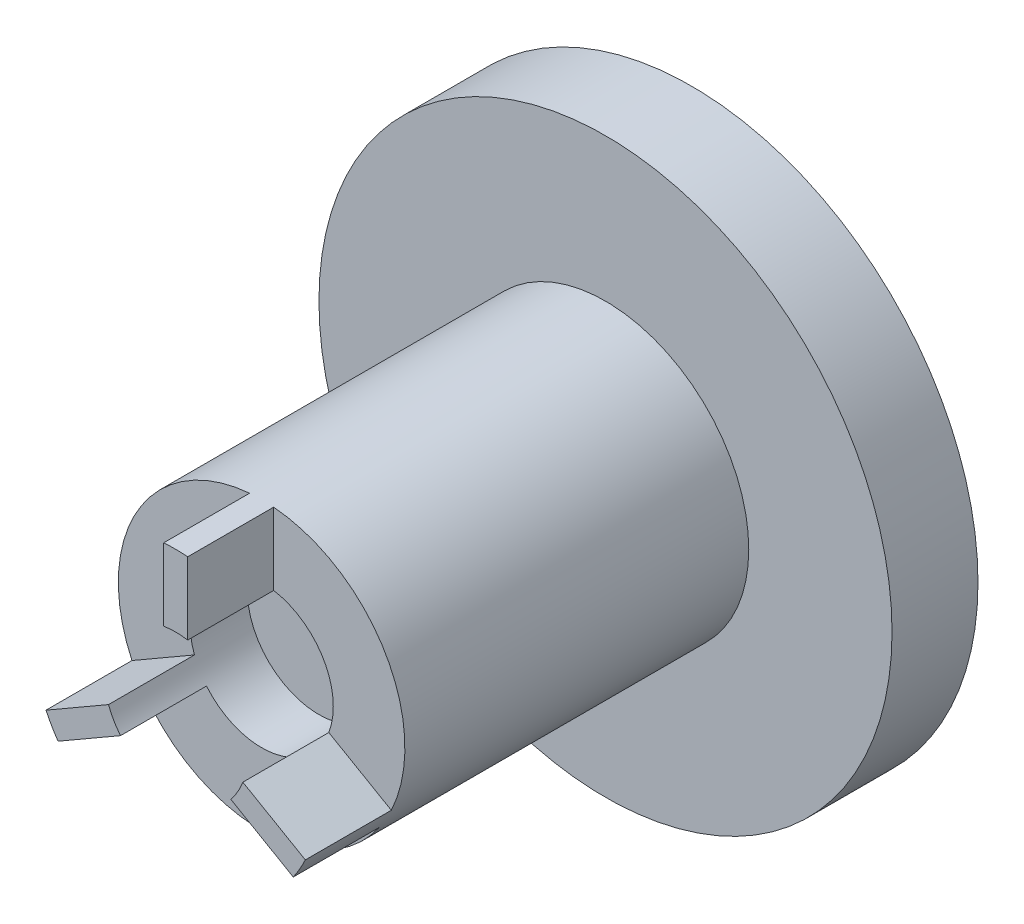
ISO-10303-21;
HEADER;
FILE_DESCRIPTION(('STEP AP214'),'2;1');
FILE_NAME('part.step','',(''),(''),'','','');
FILE_SCHEMA(('AUTOMOTIVE_DESIGN { 1 0 10303 214 1 1 1 1 }'));
ENDSEC;
DATA;
#1=APPLICATION_CONTEXT('core data for automotive mechanical design processes');
#2=APPLICATION_PROTOCOL_DEFINITION('international standard','automotive_design',2000,#1);
#3=PRODUCT_CONTEXT('',#1,'mechanical');
#4=PRODUCT('Part','Part','',(#3));
#5=PRODUCT_RELATED_PRODUCT_CATEGORY('part','',(#4));
#6=PRODUCT_DEFINITION_FORMATION('','',#4);
#7=PRODUCT_DEFINITION_CONTEXT('part definition',#1,'design');
#8=PRODUCT_DEFINITION('design','',#6,#7);
#9=PRODUCT_DEFINITION_SHAPE('','',#8);
#10=(LENGTH_UNIT() NAMED_UNIT(*) SI_UNIT(.MILLI.,.METRE.));
#11=(NAMED_UNIT(*) PLANE_ANGLE_UNIT() SI_UNIT($,.RADIAN.));
#12=(NAMED_UNIT(*) SI_UNIT($,.STERADIAN.) SOLID_ANGLE_UNIT());
#13=UNCERTAINTY_MEASURE_WITH_UNIT(LENGTH_MEASURE(1.E-05),#10,'distance_accuracy_value','');
#14=(GEOMETRIC_REPRESENTATION_CONTEXT(3) GLOBAL_UNCERTAINTY_ASSIGNED_CONTEXT((#13)) GLOBAL_UNIT_ASSIGNED_CONTEXT((#10,
#11,#12)) REPRESENTATION_CONTEXT('',''));
#15=CARTESIAN_POINT('',(0.,0.,0.));
#16=DIRECTION('',(0.,0.,1.));
#17=DIRECTION('',(1.,0.,0.));
#18=AXIS2_PLACEMENT_3D('',#15,#16,#17);
#19=CARTESIAN_POINT('',(0.,0.,16.5));
#20=DIRECTION('',(0.,0.,-1.));
#21=DIRECTION('',(-1.,0.,0.));
#22=AXIS2_PLACEMENT_3D('',#19,#20,#21);
#23=CYLINDRICAL_SURFACE('',#22,5.);
#24=CARTESIAN_POINT('',(0.,0.,1.5));
#25=DIRECTION('',(0.,0.,1.));
#26=DIRECTION('',(1.,0.,0.));
#27=AXIS2_PLACEMENT_3D('',#24,#25,#26);
#28=CIRCLE('',#27,5.);
#29=CARTESIAN_POINT('',(5.,0.,1.5));
#30=VERTEX_POINT('',#29);
#31=EDGE_CURVE('E12',#30,#30,#28,.T.);
#32=ORIENTED_EDGE('',*,*,#31,.T.);
#33=EDGE_LOOP('',(#32));
#34=FACE_BOUND('',#33,.T.);
#35=DIRECTION('',(0.,0.,1.));
#36=VECTOR('',#35,1.);
#37=CARTESIAN_POINT('',(0.420666808842573,4.98227251722928,13.5));
#38=LINE('',#37,#36);
#39=CARTESIAN_POINT('',(0.420666808842573,4.98227251722928,13.5));
#40=VERTEX_POINT('',#39);
#41=CARTESIAN_POINT('',(0.420666808842573,4.98227251722928,16.5));
#42=VERTEX_POINT('',#41);
#43=EDGE_CURVE('E244',#40,#42,#38,.T.);
#44=ORIENTED_EDGE('',*,*,#43,.F.);
#45=CARTESIAN_POINT('',(0.,0.,13.5));
#46=DIRECTION('',(0.,0.,1.));
#47=DIRECTION('',(1.,0.,0.));
#48=AXIS2_PLACEMENT_3D('',#45,#46,#47);
#49=CIRCLE('',#48,5.);
#50=CARTESIAN_POINT('',(4.52510797291888,-2.12682811562806,13.5));
#51=VERTEX_POINT('',#50);
#52=EDGE_CURVE('E227',#51,#40,#49,.T.);
#53=ORIENTED_EDGE('',*,*,#52,.F.);
#54=DIRECTION('',(0.,0.,1.));
#55=VECTOR('',#54,1.);
#56=CARTESIAN_POINT('',(4.52510797291888,-2.12682811562806,13.5));
#57=LINE('',#56,#55);
#58=CARTESIAN_POINT('',(4.52510797291888,-2.12682811562806,16.5));
#59=VERTEX_POINT('',#58);
#60=EDGE_CURVE('E247',#51,#59,#57,.T.);
#61=ORIENTED_EDGE('',*,*,#60,.T.);
#62=CARTESIAN_POINT('',(0.,0.,16.5));
#63=DIRECTION('',(0.,0.,1.));
#64=DIRECTION('',(1.,0.,0.));
#65=AXIS2_PLACEMENT_3D('',#62,#63,#64);
#66=CIRCLE('',#65,5.);
#67=CARTESIAN_POINT('',(4.10444116407631,-2.85544440160125,16.5));
#68=VERTEX_POINT('',#67);
#69=EDGE_CURVE('E292',#68,#59,#66,.T.);
#70=ORIENTED_EDGE('',*,*,#69,.F.);
#71=DIRECTION('',(0.,0.,1.));
#72=VECTOR('',#71,1.);
#73=CARTESIAN_POINT('',(4.10444116407631,-2.85544440160125,13.5));
#74=LINE('',#73,#72);
#75=CARTESIAN_POINT('',(4.10444116407631,-2.85544440160125,13.5));
#76=VERTEX_POINT('',#75);
#77=EDGE_CURVE('E214',#76,#68,#74,.T.);
#78=ORIENTED_EDGE('',*,*,#77,.F.);
#79=CARTESIAN_POINT('',(0.,0.,13.5));
#80=DIRECTION('',(0.,0.,1.));
#81=DIRECTION('',(1.,0.,0.));
#82=AXIS2_PLACEMENT_3D('',#79,#80,#81);
#83=CIRCLE('',#82,5.);
#84=CARTESIAN_POINT('',(-4.10444116407634,-2.8554444016012,13.5));
#85=VERTEX_POINT('',#84);
#86=EDGE_CURVE('E194',#85,#76,#83,.T.);
#87=ORIENTED_EDGE('',*,*,#86,.F.);
#88=DIRECTION('',(0.,0.,1.));
#89=VECTOR('',#88,1.);
#90=CARTESIAN_POINT('',(-4.10444116407634,-2.8554444016012,13.5));
#91=LINE('',#90,#89);
#92=CARTESIAN_POINT('',(-4.10444116407634,-2.8554444016012,16.5));
#93=VERTEX_POINT('',#92);
#94=EDGE_CURVE('E191',#85,#93,#91,.T.);
#95=ORIENTED_EDGE('',*,*,#94,.T.);
#96=CARTESIAN_POINT('',(-4.52510797291891,-2.126828115628,16.5));
#97=VERTEX_POINT('',#96);
#98=EDGE_CURVE('E300',#97,#93,#66,.T.);
#99=ORIENTED_EDGE('',*,*,#98,.F.);
#100=DIRECTION('',(0.,0.,1.));
#101=VECTOR('',#100,1.);
#102=CARTESIAN_POINT('',(-4.52510797291891,-2.126828115628,13.5));
#103=LINE('',#102,#101);
#104=CARTESIAN_POINT('',(-4.52510797291891,-2.126828115628,13.5));
#105=VERTEX_POINT('',#104);
#106=EDGE_CURVE('E275',#105,#97,#103,.T.);
#107=ORIENTED_EDGE('',*,*,#106,.F.);
#108=CARTESIAN_POINT('',(0.,0.,13.5));
#109=DIRECTION('',(0.,0.,1.));
#110=DIRECTION('',(1.,0.,0.));
#111=AXIS2_PLACEMENT_3D('',#108,#109,#110);
#112=CIRCLE('',#111,5.);
#113=CARTESIAN_POINT('',(-0.420666808842573,4.98227251722928,13.5));
#114=VERTEX_POINT('',#113);
#115=EDGE_CURVE('E265',#114,#105,#112,.T.);
#116=ORIENTED_EDGE('',*,*,#115,.F.);
#117=DIRECTION('',(0.,0.,1.));
#118=VECTOR('',#117,1.);
#119=CARTESIAN_POINT('',(-0.420666808842573,4.98227251722928,13.5));
#120=LINE('',#119,#118);
#121=CARTESIAN_POINT('',(-0.420666808842573,4.98227251722928,16.5));
#122=VERTEX_POINT('',#121);
#123=EDGE_CURVE('E279',#114,#122,#120,.T.);
#124=ORIENTED_EDGE('',*,*,#123,.T.);
#125=EDGE_CURVE('E297',#42,#122,#66,.T.);
#126=ORIENTED_EDGE('',*,*,#125,.F.);
#127=EDGE_LOOP('',(#44,#53,#61,#70,#78,#87,#95,#99,#107,#116,#124,#126));
#128=FACE_BOUND('',#127,.T.);
#129=ADVANCED_FACE('F92',(#34,#128),#23,.T.);
#130=CARTESIAN_POINT('',(0.,0.,16.5));
#131=DIRECTION('',(0.,0.,1.));
#132=DIRECTION('',(1.,0.,0.));
#133=AXIS2_PLACEMENT_3D('',#130,#131,#132);
#134=PLANE('',#133);
#135=CARTESIAN_POINT('',(0.,0.,16.5));
#136=DIRECTION('',(0.,0.,1.));
#137=DIRECTION('',(1.,0.,0.));
#138=AXIS2_PLACEMENT_3D('',#135,#136,#137);
#139=CIRCLE('',#138,2.5);
#140=CARTESIAN_POINT('',(0.420666808842573,2.46435375624893,16.5));
#141=VERTEX_POINT('',#140);
#142=CARTESIAN_POINT('',(-0.420666808842573,2.46435375624893,16.5));
#143=VERTEX_POINT('',#142);
#144=EDGE_CURVE('E293',#141,#143,#139,.T.);
#145=ORIENTED_EDGE('',*,*,#144,.F.);
#146=DIRECTION('',(0.,1.,0.));
#147=VECTOR('',#146,1.);
#148=CARTESIAN_POINT('',(0.420666808842573,0.,16.5));
#149=LINE('',#148,#147);
#150=EDGE_CURVE('E223',#141,#42,#149,.T.);
#151=ORIENTED_EDGE('',*,*,#150,.T.);
#152=ORIENTED_EDGE('',*,*,#125,.T.);
#153=DIRECTION('',(0.,1.,0.));
#154=VECTOR('',#153,1.);
#155=CARTESIAN_POINT('',(-0.420666808842573,0.,16.5));
#156=LINE('',#155,#154);
#157=EDGE_CURVE('E257',#143,#122,#156,.T.);
#158=ORIENTED_EDGE('',*,*,#157,.F.);
#159=EDGE_LOOP('',(#145,#151,#152,#158));
#160=FACE_BOUND('',#159,.T.);
#161=ADVANCED_FACE('F324',(#160),#134,.T.);
#162=DIRECTION('',(0.866025403784436,-0.500000000000004,0.));
#163=VECTOR('',#162,1.);
#164=CARTESIAN_POINT('',(0.210333404421288,0.364308142986599,16.5));
#165=LINE('',#164,#163);
#166=CARTESIAN_POINT('',(2.34452636124446,-0.867868735137875,16.5));
#167=VERTEX_POINT('',#166);
#168=EDGE_CURVE('E233',#167,#59,#165,.T.);
#169=ORIENTED_EDGE('',*,*,#168,.F.);
#170=CARTESIAN_POINT('',(1.92385955240188,-1.59648502111107,16.5));
#171=VERTEX_POINT('',#170);
#172=EDGE_CURVE('E278',#171,#167,#139,.T.);
#173=ORIENTED_EDGE('',*,*,#172,.F.);
#174=DIRECTION('',(0.866025403784436,-0.500000000000004,0.));
#175=VECTOR('',#174,1.);
#176=CARTESIAN_POINT('',(-0.210333404421288,-0.3643081429866,16.5));
#177=LINE('',#176,#175);
#178=EDGE_CURVE('E202',#171,#68,#177,.T.);
#179=ORIENTED_EDGE('',*,*,#178,.T.);
#180=ORIENTED_EDGE('',*,*,#69,.T.);
#181=EDGE_LOOP('',(#169,#173,#179,#180));
#182=FACE_BOUND('',#181,.T.);
#183=ADVANCED_FACE('F330',(#182),#134,.T.);
#184=DIRECTION('',(-0.866025403784443,-0.499999999999992,0.));
#185=VECTOR('',#184,1.);
#186=CARTESIAN_POINT('',(0.210333404421283,-0.364308142986602,16.5));
#187=LINE('',#186,#185);
#188=CARTESIAN_POINT('',(-1.92385955240191,-1.59648502111105,16.5));
#189=VERTEX_POINT('',#188);
#190=EDGE_CURVE('E515',#189,#93,#187,.T.);
#191=ORIENTED_EDGE('',*,*,#190,.F.);
#192=CARTESIAN_POINT('',(-2.34452636124447,-0.867868735137843,16.5));
#193=VERTEX_POINT('',#192);
#194=EDGE_CURVE('E209',#193,#189,#139,.T.);
#195=ORIENTED_EDGE('',*,*,#194,.F.);
#196=DIRECTION('',(-0.866025403784443,-0.499999999999992,0.));
#197=VECTOR('',#196,1.);
#198=CARTESIAN_POINT('',(-0.210333404421283,0.364308142986602,16.5));
#199=LINE('',#198,#197);
#200=EDGE_CURVE('E243',#193,#97,#199,.T.);
#201=ORIENTED_EDGE('',*,*,#200,.T.);
#202=ORIENTED_EDGE('',*,*,#98,.T.);
#203=EDGE_LOOP('',(#191,#195,#201,#202));
#204=FACE_BOUND('',#203,.T.);
#205=ADVANCED_FACE('F333',(#204),#134,.T.);
#206=CARTESIAN_POINT('',(0.,0.,11.5));
#207=DIRECTION('',(0.,0.,1.));
#208=DIRECTION('',(1.,0.,0.));
#209=AXIS2_PLACEMENT_3D('',#206,#207,#208);
#210=CYLINDRICAL_SURFACE('',#209,2.5);
#211=CARTESIAN_POINT('',(0.,0.,11.5));
#212=DIRECTION('',(0.,0.,1.));
#213=DIRECTION('',(1.,0.,0.));
#214=AXIS2_PLACEMENT_3D('',#211,#212,#213);
#215=CIRCLE('',#214,2.5);
#216=CARTESIAN_POINT('',(2.5,0.,11.5));
#217=VERTEX_POINT('',#216);
#218=EDGE_CURVE('E288',#217,#217,#215,.T.);
#219=ORIENTED_EDGE('',*,*,#218,.F.);
#220=EDGE_LOOP('',(#219));
#221=FACE_BOUND('',#220,.T.);
#222=DIRECTION('',(0.,0.,1.));
#223=VECTOR('',#222,1.);
#224=CARTESIAN_POINT('',(0.420666808842573,2.46435375624893,13.5));
#225=LINE('',#224,#223);
#226=CARTESIAN_POINT('',(0.420666808842573,2.46435375624893,13.5));
#227=VERTEX_POINT('',#226);
#228=EDGE_CURVE('E240',#227,#141,#225,.T.);
#229=ORIENTED_EDGE('',*,*,#228,.T.);
#230=ORIENTED_EDGE('',*,*,#144,.T.);
#231=DIRECTION('',(0.,0.,1.));
#232=VECTOR('',#231,1.);
#233=CARTESIAN_POINT('',(-0.420666808842573,2.46435375624893,13.5));
#234=LINE('',#233,#232);
#235=CARTESIAN_POINT('',(-0.420666808842573,2.46435375624893,13.5));
#236=VERTEX_POINT('',#235);
#237=EDGE_CURVE('E283',#236,#143,#234,.T.);
#238=ORIENTED_EDGE('',*,*,#237,.F.);
#239=CARTESIAN_POINT('',(0.,0.,13.5));
#240=DIRECTION('',(0.,0.,1.));
#241=DIRECTION('',(1.,0.,0.));
#242=AXIS2_PLACEMENT_3D('',#239,#240,#241);
#243=CIRCLE('',#242,2.5);
#244=CARTESIAN_POINT('',(-2.34452636124447,-0.867868735137843,13.5));
#245=VERTEX_POINT('',#244);
#246=EDGE_CURVE('E256',#245,#236,#243,.F.);
#247=ORIENTED_EDGE('',*,*,#246,.F.);
#248=DIRECTION('',(0.,0.,1.));
#249=VECTOR('',#248,1.);
#250=CARTESIAN_POINT('',(-2.34452636124447,-0.867868735137843,13.5));
#251=LINE('',#250,#249);
#252=EDGE_CURVE('E269',#245,#193,#251,.T.);
#253=ORIENTED_EDGE('',*,*,#252,.T.);
#254=ORIENTED_EDGE('',*,*,#194,.T.);
#255=DIRECTION('',(0.,0.,1.));
#256=VECTOR('',#255,1.);
#257=CARTESIAN_POINT('',(-1.92385955240191,-1.59648502111105,13.5));
#258=LINE('',#257,#256);
#259=CARTESIAN_POINT('',(-1.92385955240191,-1.59648502111105,13.5));
#260=VERTEX_POINT('',#259);
#261=EDGE_CURVE('E188',#260,#189,#258,.T.);
#262=ORIENTED_EDGE('',*,*,#261,.F.);
#263=CARTESIAN_POINT('',(0.,0.,13.5));
#264=DIRECTION('',(0.,0.,1.));
#265=DIRECTION('',(1.,0.,0.));
#266=AXIS2_PLACEMENT_3D('',#263,#264,#265);
#267=CIRCLE('',#266,2.5);
#268=CARTESIAN_POINT('',(1.92385955240188,-1.59648502111107,13.5));
#269=VERTEX_POINT('',#268);
#270=EDGE_CURVE('E195',#269,#260,#267,.F.);
#271=ORIENTED_EDGE('',*,*,#270,.F.);
#272=DIRECTION('',(0.,0.,1.));
#273=VECTOR('',#272,1.);
#274=CARTESIAN_POINT('',(1.92385955240188,-1.59648502111107,13.5));
#275=LINE('',#274,#273);
#276=EDGE_CURVE('E236',#269,#171,#275,.T.);
#277=ORIENTED_EDGE('',*,*,#276,.T.);
#278=ORIENTED_EDGE('',*,*,#172,.T.);
#279=DIRECTION('',(0.,0.,1.));
#280=VECTOR('',#279,1.);
#281=CARTESIAN_POINT('',(2.34452636124446,-0.867868735137875,13.5));
#282=LINE('',#281,#280);
#283=CARTESIAN_POINT('',(2.34452636124446,-0.867868735137875,13.5));
#284=VERTEX_POINT('',#283);
#285=EDGE_CURVE('E232',#284,#167,#282,.T.);
#286=ORIENTED_EDGE('',*,*,#285,.F.);
#287=CARTESIAN_POINT('',(0.,0.,13.5));
#288=DIRECTION('',(0.,0.,1.));
#289=DIRECTION('',(1.,0.,0.));
#290=AXIS2_PLACEMENT_3D('',#287,#288,#289);
#291=CIRCLE('',#290,2.5);
#292=EDGE_CURVE('E219',#227,#284,#291,.F.);
#293=ORIENTED_EDGE('',*,*,#292,.F.);
#294=EDGE_LOOP('',(#229,#230,#238,#247,#253,#254,#262,#271,#277,#278,#286,#293));
#295=FACE_BOUND('',#294,.T.);
#296=ADVANCED_FACE('F206',(#221,#295),#210,.F.);
#297=CARTESIAN_POINT('',(0.,0.,1.5));
#298=DIRECTION('',(0.,0.,-1.));
#299=DIRECTION('',(-1.,0.,0.));
#300=AXIS2_PLACEMENT_3D('',#297,#298,#299);
#301=CYLINDRICAL_SURFACE('',#300,10.);
#302=CARTESIAN_POINT('',(0.,0.,1.5));
#303=DIRECTION('',(0.,0.,1.));
#304=DIRECTION('',(1.,0.,0.));
#305=AXIS2_PLACEMENT_3D('',#302,#303,#304);
#306=CIRCLE('',#305,10.);
#307=CARTESIAN_POINT('',(10.,0.,1.5));
#308=VERTEX_POINT('',#307);
#309=EDGE_CURVE('E102',#308,#308,#306,.T.);
#310=ORIENTED_EDGE('',*,*,#309,.F.);
#311=EDGE_LOOP('',(#310));
#312=FACE_BOUND('',#311,.T.);
#313=CARTESIAN_POINT('',(0.,0.,-1.5));
#314=DIRECTION('',(0.,0.,1.));
#315=DIRECTION('',(1.,0.,0.));
#316=AXIS2_PLACEMENT_3D('',#313,#314,#315);
#317=CIRCLE('',#316,10.);
#318=CARTESIAN_POINT('',(10.,0.,-1.5));
#319=VERTEX_POINT('',#318);
#320=EDGE_CURVE('E96',#319,#319,#317,.T.);
#321=ORIENTED_EDGE('',*,*,#320,.T.);
#322=EDGE_LOOP('',(#321));
#323=FACE_BOUND('',#322,.T.);
#324=ADVANCED_FACE('F94',(#312,#323),#301,.T.);
#325=CARTESIAN_POINT('',(0.,0.,1.5));
#326=DIRECTION('',(0.,0.,1.));
#327=DIRECTION('',(1.,0.,0.));
#328=AXIS2_PLACEMENT_3D('',#325,#326,#327);
#329=PLANE('',#328);
#330=ORIENTED_EDGE('',*,*,#31,.F.);
#331=EDGE_LOOP('',(#330));
#332=FACE_BOUND('',#331,.T.);
#333=ORIENTED_EDGE('',*,*,#309,.T.);
#334=EDGE_LOOP('',(#333));
#335=FACE_BOUND('',#334,.T.);
#336=ADVANCED_FACE('F313',(#332,#335),#329,.T.);
#337=CARTESIAN_POINT('',(0.,0.,-1.5));
#338=DIRECTION('',(0.,0.,1.));
#339=DIRECTION('',(1.,0.,0.));
#340=AXIS2_PLACEMENT_3D('',#337,#338,#339);
#341=PLANE('',#340);
#342=ORIENTED_EDGE('',*,*,#320,.F.);
#343=EDGE_LOOP('',(#342));
#344=FACE_BOUND('',#343,.T.);
#345=ADVANCED_FACE('F310',(#344),#341,.F.);
#346=CARTESIAN_POINT('',(0.,0.,11.5));
#347=DIRECTION('',(0.,0.,1.));
#348=DIRECTION('',(1.,0.,0.));
#349=AXIS2_PLACEMENT_3D('',#346,#347,#348);
#350=PLANE('',#349);
#351=ORIENTED_EDGE('',*,*,#218,.T.);
#352=EDGE_LOOP('',(#351));
#353=FACE_BOUND('',#352,.T.);
#354=ADVANCED_FACE('F312',(#353),#350,.T.);
#355=CARTESIAN_POINT('',(-0.210333404421283,0.364308142986602,13.5));
#356=DIRECTION('',(-0.499999999999992,0.866025403784443,0.));
#357=DIRECTION('',(-0.866025403784443,-0.499999999999992,0.));
#358=AXIS2_PLACEMENT_3D('',#355,#356,#357);
#359=PLANE('',#358);
#360=ORIENTED_EDGE('',*,*,#200,.F.);
#361=ORIENTED_EDGE('',*,*,#252,.F.);
#362=DIRECTION('',(-0.866025403784443,-0.499999999999992,0.));
#363=VECTOR('',#362,1.);
#364=CARTESIAN_POINT('',(-0.210333404421283,0.364308142986602,13.5));
#365=LINE('',#364,#363);
#366=EDGE_CURVE('E253',#245,#105,#365,.T.);
#367=ORIENTED_EDGE('',*,*,#366,.T.);
#368=ORIENTED_EDGE('',*,*,#106,.T.);
#369=EDGE_LOOP('',(#360,#361,#367,#368));
#370=FACE_BOUND('',#369,.T.);
#371=ADVANCED_FACE('F318',(#370),#359,.T.);
#372=CARTESIAN_POINT('',(-0.420666808842573,0.,13.5));
#373=DIRECTION('',(1.,0.,0.));
#374=DIRECTION('',(0.,0.,-1.));
#375=AXIS2_PLACEMENT_3D('',#372,#373,#374);
#376=PLANE('',#375);
#377=ORIENTED_EDGE('',*,*,#157,.T.);
#378=ORIENTED_EDGE('',*,*,#123,.F.);
#379=DIRECTION('',(0.,1.,0.));
#380=VECTOR('',#379,1.);
#381=CARTESIAN_POINT('',(-0.420666808842573,0.,13.5));
#382=LINE('',#381,#380);
#383=EDGE_CURVE('E261',#236,#114,#382,.T.);
#384=ORIENTED_EDGE('',*,*,#383,.F.);
#385=ORIENTED_EDGE('',*,*,#237,.T.);
#386=EDGE_LOOP('',(#377,#378,#384,#385));
#387=FACE_BOUND('',#386,.T.);
#388=ADVANCED_FACE('F341',(#387),#376,.F.);
#389=CARTESIAN_POINT('',(0.,0.,13.5));
#390=DIRECTION('',(0.,0.,1.));
#391=DIRECTION('',(1.,0.,0.));
#392=AXIS2_PLACEMENT_3D('',#389,#390,#391);
#393=PLANE('',#392);
#394=ORIENTED_EDGE('',*,*,#366,.F.);
#395=ORIENTED_EDGE('',*,*,#246,.T.);
#396=ORIENTED_EDGE('',*,*,#383,.T.);
#397=ORIENTED_EDGE('',*,*,#115,.T.);
#398=EDGE_LOOP('',(#394,#395,#396,#397));
#399=FACE_BOUND('',#398,.T.);
#400=ADVANCED_FACE('F345',(#399),#393,.T.);
#401=CARTESIAN_POINT('',(-0.210333404421288,-0.3643081429866,13.5));
#402=DIRECTION('',(-0.500000000000004,-0.866025403784436,0.));
#403=DIRECTION('',(0.866025403784436,-0.500000000000004,0.));
#404=AXIS2_PLACEMENT_3D('',#401,#402,#403);
#405=PLANE('',#404);
#406=ORIENTED_EDGE('',*,*,#178,.F.);
#407=ORIENTED_EDGE('',*,*,#276,.F.);
#408=DIRECTION('',(0.866025403784436,-0.500000000000004,0.));
#409=VECTOR('',#408,1.);
#410=CARTESIAN_POINT('',(-0.210333404421288,-0.3643081429866,13.5));
#411=LINE('',#410,#409);
#412=EDGE_CURVE('E118',#269,#76,#411,.T.);
#413=ORIENTED_EDGE('',*,*,#412,.T.);
#414=ORIENTED_EDGE('',*,*,#77,.T.);
#415=EDGE_LOOP('',(#406,#407,#413,#414));
#416=FACE_BOUND('',#415,.T.);
#417=ADVANCED_FACE('F349',(#416),#405,.T.);
#418=CARTESIAN_POINT('',(0.210333404421283,-0.364308142986602,13.5));
#419=DIRECTION('',(-0.499999999999992,0.866025403784443,0.));
#420=DIRECTION('',(-0.866025403784443,-0.499999999999992,0.));
#421=AXIS2_PLACEMENT_3D('',#418,#419,#420);
#422=PLANE('',#421);
#423=ORIENTED_EDGE('',*,*,#190,.T.);
#424=ORIENTED_EDGE('',*,*,#94,.F.);
#425=DIRECTION('',(-0.866025403784443,-0.499999999999992,0.));
#426=VECTOR('',#425,1.);
#427=CARTESIAN_POINT('',(0.210333404421283,-0.364308142986602,13.5));
#428=LINE('',#427,#426);
#429=EDGE_CURVE('E185',#260,#85,#428,.T.);
#430=ORIENTED_EDGE('',*,*,#429,.F.);
#431=ORIENTED_EDGE('',*,*,#261,.T.);
#432=EDGE_LOOP('',(#423,#424,#430,#431));
#433=FACE_BOUND('',#432,.T.);
#434=ADVANCED_FACE('F186',(#433),#422,.F.);
#435=CARTESIAN_POINT('',(0.,0.,13.5));
#436=DIRECTION('',(0.,0.,1.));
#437=DIRECTION('',(1.,0.,0.));
#438=AXIS2_PLACEMENT_3D('',#435,#436,#437);
#439=PLANE('',#438);
#440=ORIENTED_EDGE('',*,*,#270,.T.);
#441=ORIENTED_EDGE('',*,*,#429,.T.);
#442=ORIENTED_EDGE('',*,*,#86,.T.);
#443=ORIENTED_EDGE('',*,*,#412,.F.);
#444=EDGE_LOOP('',(#440,#441,#442,#443));
#445=FACE_BOUND('',#444,.T.);
#446=ADVANCED_FACE('F198',(#445),#439,.T.);
#447=CARTESIAN_POINT('',(0.420666808842573,0.,13.5));
#448=DIRECTION('',(1.,0.,0.));
#449=DIRECTION('',(0.,0.,-1.));
#450=AXIS2_PLACEMENT_3D('',#447,#448,#449);
#451=PLANE('',#450);
#452=ORIENTED_EDGE('',*,*,#150,.F.);
#453=ORIENTED_EDGE('',*,*,#228,.F.);
#454=DIRECTION('',(0.,1.,0.));
#455=VECTOR('',#454,1.);
#456=CARTESIAN_POINT('',(0.420666808842573,0.,13.5));
#457=LINE('',#456,#455);
#458=EDGE_CURVE('E110',#227,#40,#457,.T.);
#459=ORIENTED_EDGE('',*,*,#458,.T.);
#460=ORIENTED_EDGE('',*,*,#43,.T.);
#461=EDGE_LOOP('',(#452,#453,#459,#460));
#462=FACE_BOUND('',#461,.T.);
#463=ADVANCED_FACE('F355',(#462),#451,.T.);
#464=CARTESIAN_POINT('',(0.210333404421288,0.364308142986599,13.5));
#465=DIRECTION('',(-0.500000000000004,-0.866025403784436,0.));
#466=DIRECTION('',(0.866025403784436,-0.500000000000004,0.));
#467=AXIS2_PLACEMENT_3D('',#464,#465,#466);
#468=PLANE('',#467);
#469=ORIENTED_EDGE('',*,*,#168,.T.);
#470=ORIENTED_EDGE('',*,*,#60,.F.);
#471=DIRECTION('',(0.866025403784436,-0.500000000000004,0.));
#472=VECTOR('',#471,1.);
#473=CARTESIAN_POINT('',(0.210333404421288,0.364308142986599,13.5));
#474=LINE('',#473,#472);
#475=EDGE_CURVE('E222',#284,#51,#474,.T.);
#476=ORIENTED_EDGE('',*,*,#475,.F.);
#477=ORIENTED_EDGE('',*,*,#285,.T.);
#478=EDGE_LOOP('',(#469,#470,#476,#477));
#479=FACE_BOUND('',#478,.T.);
#480=ADVANCED_FACE('F351',(#479),#468,.F.);
#481=CARTESIAN_POINT('',(0.,0.,13.5));
#482=DIRECTION('',(0.,0.,1.));
#483=DIRECTION('',(1.,0.,0.));
#484=AXIS2_PLACEMENT_3D('',#481,#482,#483);
#485=PLANE('',#484);
#486=ORIENTED_EDGE('',*,*,#292,.T.);
#487=ORIENTED_EDGE('',*,*,#475,.T.);
#488=ORIENTED_EDGE('',*,*,#52,.T.);
#489=ORIENTED_EDGE('',*,*,#458,.F.);
#490=EDGE_LOOP('',(#486,#487,#488,#489));
#491=FACE_BOUND('',#490,.T.);
#492=ADVANCED_FACE('F354',(#491),#485,.T.);
#493=CLOSED_SHELL('',(#129,#161,#183,#205,#296,#324,#336,#345,#354,#371,#388,#400,#417,#434,
#446,#463,#480,#492));
#494=MANIFOLD_SOLID_BREP('B2',#493);
#495=ADVANCED_BREP_SHAPE_REPRESENTATION('',(#18,#494),#14);
#496=SHAPE_DEFINITION_REPRESENTATION(#9,#495);
ENDSEC;
END-ISO-10303-21;
